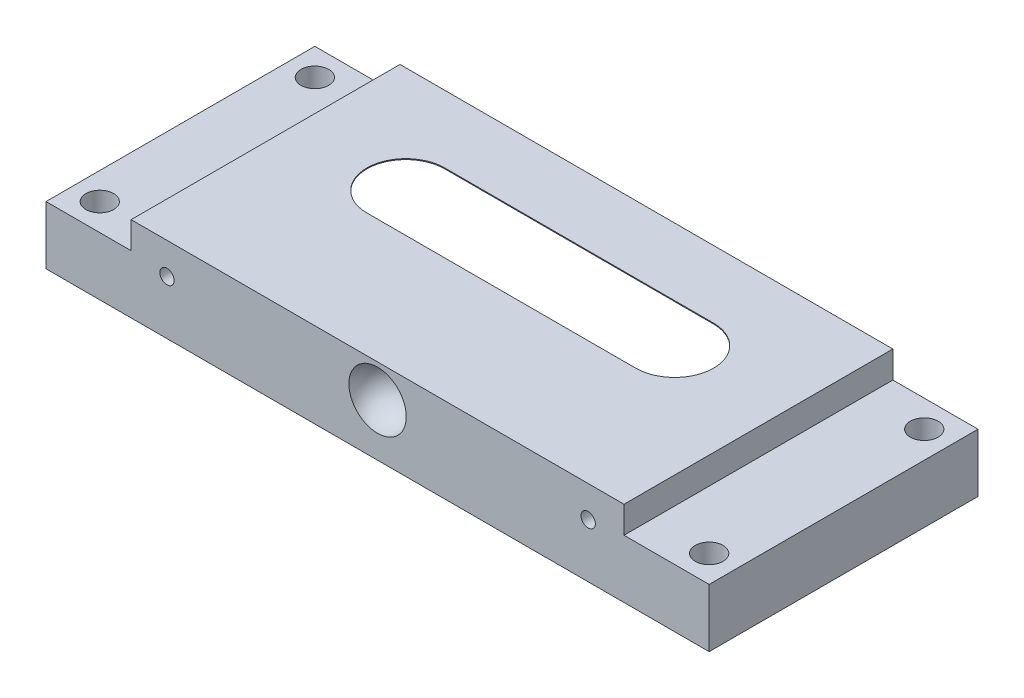
ISO-10303-21;
HEADER;
FILE_DESCRIPTION(('STEP AP214'),'2;1');
FILE_NAME('part.step','',(''),(''),'','','');
FILE_SCHEMA(('AUTOMOTIVE_DESIGN { 1 0 10303 214 1 1 1 1 }'));
ENDSEC;
DATA;
#1=APPLICATION_CONTEXT('core data for automotive mechanical design processes');
#2=APPLICATION_PROTOCOL_DEFINITION('international standard','automotive_design',2000,#1);
#3=PRODUCT_CONTEXT('',#1,'mechanical');
#4=PRODUCT('Part','Part','',(#3));
#5=PRODUCT_RELATED_PRODUCT_CATEGORY('part','',(#4));
#6=PRODUCT_DEFINITION_FORMATION('','',#4);
#7=PRODUCT_DEFINITION_CONTEXT('part definition',#1,'design');
#8=PRODUCT_DEFINITION('design','',#6,#7);
#9=PRODUCT_DEFINITION_SHAPE('','',#8);
#10=(LENGTH_UNIT() NAMED_UNIT(*) SI_UNIT(.MILLI.,.METRE.));
#11=(NAMED_UNIT(*) PLANE_ANGLE_UNIT() SI_UNIT($,.RADIAN.));
#12=(NAMED_UNIT(*) SI_UNIT($,.STERADIAN.) SOLID_ANGLE_UNIT());
#13=UNCERTAINTY_MEASURE_WITH_UNIT(LENGTH_MEASURE(1.E-05),#10,'distance_accuracy_value','');
#14=(GEOMETRIC_REPRESENTATION_CONTEXT(3) GLOBAL_UNCERTAINTY_ASSIGNED_CONTEXT((#13)) GLOBAL_UNIT_ASSIGNED_CONTEXT((#10,
#11,#12)) REPRESENTATION_CONTEXT('',''));
#15=CARTESIAN_POINT('',(0.,0.,0.));
#16=DIRECTION('',(0.,0.,1.));
#17=DIRECTION('',(1.,0.,0.));
#18=AXIS2_PLACEMENT_3D('',#15,#16,#17);
#19=CARTESIAN_POINT('',(0.,9.5,0.));
#20=DIRECTION('',(0.,0.,-1.));
#21=DIRECTION('',(-1.,0.,0.));
#22=AXIS2_PLACEMENT_3D('',#19,#20,#21);
#23=PLANE('',#22);
#24=CARTESIAN_POINT('',(60.5,6.,0.));
#25=DIRECTION('',(0.,0.,1.));
#26=DIRECTION('',(1.,0.,0.));
#27=AXIS2_PLACEMENT_3D('',#24,#25,#26);
#28=CIRCLE('',#27,0.800000000000002);
#29=CARTESIAN_POINT('',(61.3,6.,0.));
#30=VERTEX_POINT('',#29);
#31=EDGE_CURVE('E189',#30,#30,#28,.T.);
#32=ORIENTED_EDGE('',*,*,#31,.F.);
#33=EDGE_LOOP('',(#32));
#34=FACE_BOUND('',#33,.T.);
#35=CARTESIAN_POINT('',(13.5,6.,0.));
#36=DIRECTION('',(0.,0.,1.));
#37=DIRECTION('',(1.,0.,0.));
#38=AXIS2_PLACEMENT_3D('',#35,#36,#37);
#39=CIRCLE('',#38,0.800000000000001);
#40=CARTESIAN_POINT('',(14.3,6.,0.));
#41=VERTEX_POINT('',#40);
#42=EDGE_CURVE('E193',#41,#41,#39,.T.);
#43=ORIENTED_EDGE('',*,*,#42,.F.);
#44=EDGE_LOOP('',(#43));
#45=FACE_BOUND('',#44,.T.);
#46=DIRECTION('',(1.,0.,0.));
#47=VECTOR('',#46,1.);
#48=CARTESIAN_POINT('',(0.,9.5,0.));
#49=LINE('',#48,#47);
#50=CARTESIAN_POINT('',(9.5,9.5,0.));
#51=VERTEX_POINT('',#50);
#52=CARTESIAN_POINT('',(64.5,9.5,0.));
#53=VERTEX_POINT('',#52);
#54=EDGE_CURVE('E286',#51,#53,#49,.T.);
#55=ORIENTED_EDGE('',*,*,#54,.F.);
#56=DIRECTION('',(0.,1.,0.));
#57=VECTOR('',#56,1.);
#58=CARTESIAN_POINT('',(9.5,6.5,0.));
#59=LINE('',#58,#57);
#60=CARTESIAN_POINT('',(9.5,6.5,0.));
#61=VERTEX_POINT('',#60);
#62=EDGE_CURVE('E261',#61,#51,#59,.T.);
#63=ORIENTED_EDGE('',*,*,#62,.F.);
#64=DIRECTION('',(1.,0.,0.));
#65=VECTOR('',#64,1.);
#66=CARTESIAN_POINT('',(0.,6.5,0.));
#67=LINE('',#66,#65);
#68=CARTESIAN_POINT('',(0.,6.5,0.));
#69=VERTEX_POINT('',#68);
#70=EDGE_CURVE('E252',#69,#61,#67,.T.);
#71=ORIENTED_EDGE('',*,*,#70,.F.);
#72=DIRECTION('',(0.,-1.,0.));
#73=VECTOR('',#72,1.);
#74=CARTESIAN_POINT('',(0.,9.5,0.));
#75=LINE('',#74,#73);
#76=CARTESIAN_POINT('',(0.,0.,0.));
#77=VERTEX_POINT('',#76);
#78=EDGE_CURVE('E310',#69,#77,#75,.T.);
#79=ORIENTED_EDGE('',*,*,#78,.T.);
#80=DIRECTION('',(1.,0.,0.));
#81=VECTOR('',#80,1.);
#82=CARTESIAN_POINT('',(0.,0.,0.));
#83=LINE('',#82,#81);
#84=CARTESIAN_POINT('',(74.,0.,0.));
#85=VERTEX_POINT('',#84);
#86=EDGE_CURVE('E295',#77,#85,#83,.T.);
#87=ORIENTED_EDGE('',*,*,#86,.T.);
#88=DIRECTION('',(0.,-1.,0.));
#89=VECTOR('',#88,1.);
#90=CARTESIAN_POINT('',(74.,9.5,0.));
#91=LINE('',#90,#89);
#92=CARTESIAN_POINT('',(74.,6.5,0.));
#93=VERTEX_POINT('',#92);
#94=EDGE_CURVE('E308',#93,#85,#91,.T.);
#95=ORIENTED_EDGE('',*,*,#94,.F.);
#96=DIRECTION('',(1.,0.,0.));
#97=VECTOR('',#96,1.);
#98=CARTESIAN_POINT('',(74.,6.5,0.));
#99=LINE('',#98,#97);
#100=CARTESIAN_POINT('',(64.5,6.5,0.));
#101=VERTEX_POINT('',#100);
#102=EDGE_CURVE('E276',#101,#93,#99,.T.);
#103=ORIENTED_EDGE('',*,*,#102,.F.);
#104=DIRECTION('',(0.,1.,0.));
#105=VECTOR('',#104,1.);
#106=CARTESIAN_POINT('',(64.5,6.5,0.));
#107=LINE('',#106,#105);
#108=EDGE_CURVE('E281',#101,#53,#107,.T.);
#109=ORIENTED_EDGE('',*,*,#108,.T.);
#110=EDGE_LOOP('',(#55,#63,#71,#79,#87,#95,#103,#109));
#111=FACE_BOUND('',#110,.T.);
#112=CARTESIAN_POINT('',(37.,5.8,0.));
#113=DIRECTION('',(0.,0.,-1.));
#114=DIRECTION('',(-1.,0.,0.));
#115=AXIS2_PLACEMENT_3D('',#112,#113,#114);
#116=CIRCLE('',#115,3.2);
#117=CARTESIAN_POINT('',(33.8,5.8,0.));
#118=VERTEX_POINT('',#117);
#119=EDGE_CURVE('E199',#118,#118,#116,.F.);
#120=ORIENTED_EDGE('',*,*,#119,.F.);
#121=EDGE_LOOP('',(#120));
#122=FACE_BOUND('',#121,.T.);
#123=ADVANCED_FACE('F32',(#34,#45,#111,#122),#23,.F.);
#124=CARTESIAN_POINT('',(22.,-11.5,-18.15));
#125=DIRECTION('',(0.,0.,1.));
#126=DIRECTION('',(1.,0.,0.));
#127=AXIS2_PLACEMENT_3D('',#124,#125,#126);
#128=SPHERICAL_SURFACE('',#127,21.35);
#129=CARTESIAN_POINT('',(22.,-11.5,-18.15));
#130=DIRECTION('',(1.,0.,0.));
#131=DIRECTION('',(0.,0.,-1.));
#132=AXIS2_PLACEMENT_3D('',#129,#130,#131);
#133=CIRCLE('',#132,21.35);
#134=CARTESIAN_POINT('',(22.,6.25950449759227,-30.));
#135=VERTEX_POINT('',#134);
#136=CARTESIAN_POINT('',(22.,9.40215299915298,-22.5));
#137=VERTEX_POINT('',#136);
#138=EDGE_CURVE('E205',#135,#137,#133,.T.);
#139=ORIENTED_EDGE('',*,*,#138,.T.);
#140=CARTESIAN_POINT('',(22.,9.40215299915298,-18.15));
#141=DIRECTION('',(0.,-1.,0.));
#142=DIRECTION('',(0.,0.,-1.));
#143=AXIS2_PLACEMENT_3D('',#140,#141,#142);
#144=CIRCLE('',#143,4.35000000000002);
#145=CARTESIAN_POINT('',(22.,9.40215299915298,-13.8));
#146=VERTEX_POINT('',#145);
#147=EDGE_CURVE('E174',#137,#146,#144,.F.);
#148=ORIENTED_EDGE('',*,*,#147,.T.);
#149=CARTESIAN_POINT('',(22.,-11.5,-18.15));
#150=DIRECTION('',(1.,0.,0.));
#151=DIRECTION('',(0.,0.,-1.));
#152=AXIS2_PLACEMENT_3D('',#149,#150,#151);
#153=CIRCLE('',#152,21.35);
#154=CARTESIAN_POINT('',(22.,0.,-0.161878919687027));
#155=VERTEX_POINT('',#154);
#156=EDGE_CURVE('E322',#155,#146,#153,.F.);
#157=ORIENTED_EDGE('',*,*,#156,.F.);
#158=CARTESIAN_POINT('',(22.,0.,-18.15));
#159=DIRECTION('',(0.,-1.,0.));
#160=DIRECTION('',(0.,0.,-1.));
#161=AXIS2_PLACEMENT_3D('',#158,#159,#160);
#162=CIRCLE('',#161,17.988121080313);
#163=CARTESIAN_POINT('',(8.46670771763205,0.,-30.));
#164=VERTEX_POINT('',#163);
#165=EDGE_CURVE('E214',#155,#164,#162,.T.);
#166=ORIENTED_EDGE('',*,*,#165,.T.);
#167=CARTESIAN_POINT('',(22.,-11.5,-30.));
#168=DIRECTION('',(0.,0.,1.));
#169=DIRECTION('',(1.,0.,0.));
#170=AXIS2_PLACEMENT_3D('',#167,#168,#169);
#171=CIRCLE('',#170,17.7595044975923);
#172=EDGE_CURVE('E217',#135,#164,#171,.T.);
#173=ORIENTED_EDGE('',*,*,#172,.F.);
#174=EDGE_LOOP('',(#139,#148,#157,#166,#173));
#175=FACE_BOUND('',#174,.T.);
#176=ADVANCED_FACE('F344',(#175),#128,.F.);
#177=CARTESIAN_POINT('',(0.,9.5,-30.));
#178=DIRECTION('',(0.,0.,1.));
#179=DIRECTION('',(1.,0.,0.));
#180=AXIS2_PLACEMENT_3D('',#177,#178,#179);
#181=PLANE('',#180);
#182=CARTESIAN_POINT('',(6.5,4.5,-30.));
#183=DIRECTION('',(0.,0.,-1.));
#184=DIRECTION('',(-1.,0.,0.));
#185=AXIS2_PLACEMENT_3D('',#182,#183,#184);
#186=CIRCLE('',#185,1.24999999999999);
#187=CARTESIAN_POINT('',(5.25000000000001,4.5,-30.));
#188=VERTEX_POINT('',#187);
#189=EDGE_CURVE('E177',#188,#188,#186,.T.);
#190=ORIENTED_EDGE('',*,*,#189,.F.);
#191=EDGE_LOOP('',(#190));
#192=FACE_BOUND('',#191,.T.);
#193=CARTESIAN_POINT('',(67.5,4.5,-30.));
#194=DIRECTION('',(0.,0.,-1.));
#195=DIRECTION('',(-1.,0.,0.));
#196=AXIS2_PLACEMENT_3D('',#193,#194,#195);
#197=CIRCLE('',#196,1.24999999999999);
#198=CARTESIAN_POINT('',(66.25,4.5,-30.));
#199=VERTEX_POINT('',#198);
#200=EDGE_CURVE('E183',#199,#199,#197,.T.);
#201=ORIENTED_EDGE('',*,*,#200,.F.);
#202=EDGE_LOOP('',(#201));
#203=FACE_BOUND('',#202,.T.);
#204=CARTESIAN_POINT('',(52.,-11.5,-30.));
#205=DIRECTION('',(0.,0.,1.));
#206=DIRECTION('',(1.,0.,0.));
#207=AXIS2_PLACEMENT_3D('',#204,#205,#206);
#208=CIRCLE('',#207,17.7595044975923);
#209=CARTESIAN_POINT('',(52.,6.25950449759227,-30.));
#210=VERTEX_POINT('',#209);
#211=CARTESIAN_POINT('',(65.533292282368,0.,-30.));
#212=VERTEX_POINT('',#211);
#213=EDGE_CURVE('E219',#210,#212,#208,.F.);
#214=ORIENTED_EDGE('',*,*,#213,.F.);
#215=DIRECTION('',(1.,0.,0.));
#216=VECTOR('',#215,1.);
#217=CARTESIAN_POINT('',(52.,6.25950449759227,-30.));
#218=LINE('',#217,#216);
#219=EDGE_CURVE('E211',#210,#135,#218,.F.);
#220=ORIENTED_EDGE('',*,*,#219,.T.);
#221=ORIENTED_EDGE('',*,*,#172,.T.);
#222=DIRECTION('',(-1.,0.,0.));
#223=VECTOR('',#222,1.);
#224=CARTESIAN_POINT('',(0.,0.,-30.));
#225=LINE('',#224,#223);
#226=CARTESIAN_POINT('',(0.,0.,-30.));
#227=VERTEX_POINT('',#226);
#228=EDGE_CURVE('E301',#164,#227,#225,.T.);
#229=ORIENTED_EDGE('',*,*,#228,.T.);
#230=DIRECTION('',(0.,-1.,0.));
#231=VECTOR('',#230,1.);
#232=CARTESIAN_POINT('',(0.,9.5,-30.));
#233=LINE('',#232,#231);
#234=CARTESIAN_POINT('',(0.,6.5,-30.));
#235=VERTEX_POINT('',#234);
#236=EDGE_CURVE('E292',#235,#227,#233,.T.);
#237=ORIENTED_EDGE('',*,*,#236,.F.);
#238=DIRECTION('',(-1.,0.,0.));
#239=VECTOR('',#238,1.);
#240=CARTESIAN_POINT('',(0.,6.5,-30.));
#241=LINE('',#240,#239);
#242=CARTESIAN_POINT('',(9.5,6.5,-30.));
#243=VERTEX_POINT('',#242);
#244=EDGE_CURVE('E259',#243,#235,#241,.T.);
#245=ORIENTED_EDGE('',*,*,#244,.F.);
#246=DIRECTION('',(0.,1.,0.));
#247=VECTOR('',#246,1.);
#248=CARTESIAN_POINT('',(9.5,6.5,-30.));
#249=LINE('',#248,#247);
#250=CARTESIAN_POINT('',(9.5,9.5,-30.));
#251=VERTEX_POINT('',#250);
#252=EDGE_CURVE('E263',#243,#251,#249,.T.);
#253=ORIENTED_EDGE('',*,*,#252,.T.);
#254=DIRECTION('',(-1.,0.,0.));
#255=VECTOR('',#254,1.);
#256=CARTESIAN_POINT('',(0.,9.5,-30.));
#257=LINE('',#256,#255);
#258=CARTESIAN_POINT('',(64.5,9.5,-30.));
#259=VERTEX_POINT('',#258);
#260=EDGE_CURVE('E288',#259,#251,#257,.T.);
#261=ORIENTED_EDGE('',*,*,#260,.F.);
#262=DIRECTION('',(0.,1.,0.));
#263=VECTOR('',#262,1.);
#264=CARTESIAN_POINT('',(64.5,6.5,-30.));
#265=LINE('',#264,#263);
#266=CARTESIAN_POINT('',(64.5,6.5,-30.));
#267=VERTEX_POINT('',#266);
#268=EDGE_CURVE('E278',#267,#259,#265,.T.);
#269=ORIENTED_EDGE('',*,*,#268,.F.);
#270=DIRECTION('',(-1.,0.,0.));
#271=VECTOR('',#270,1.);
#272=CARTESIAN_POINT('',(74.,6.5,-30.));
#273=LINE('',#272,#271);
#274=CARTESIAN_POINT('',(74.,6.5,-30.));
#275=VERTEX_POINT('',#274);
#276=EDGE_CURVE('E270',#275,#267,#273,.T.);
#277=ORIENTED_EDGE('',*,*,#276,.F.);
#278=DIRECTION('',(0.,-1.,0.));
#279=VECTOR('',#278,1.);
#280=CARTESIAN_POINT('',(74.,9.5,-30.));
#281=LINE('',#280,#279);
#282=CARTESIAN_POINT('',(74.,0.,-30.));
#283=VERTEX_POINT('',#282);
#284=EDGE_CURVE('E306',#275,#283,#281,.T.);
#285=ORIENTED_EDGE('',*,*,#284,.T.);
#286=EDGE_CURVE('E289',#283,#212,#225,.T.);
#287=ORIENTED_EDGE('',*,*,#286,.T.);
#288=EDGE_LOOP('',(#214,#220,#221,#229,#237,#245,#253,#261,#269,#277,#285,#287));
#289=FACE_BOUND('',#288,.T.);
#290=ADVANCED_FACE('F353',(#192,#203,#289),#181,.F.);
#291=CARTESIAN_POINT('',(0.,9.5,0.));
#292=DIRECTION('',(0.,-1.,0.));
#293=DIRECTION('',(0.,0.,-1.));
#294=AXIS2_PLACEMENT_3D('',#291,#292,#293);
#295=PLANE('',#294);
#296=DIRECTION('',(1.,0.,0.));
#297=VECTOR('',#296,1.);
#298=CARTESIAN_POINT('',(52.,9.5,-13.8));
#299=LINE('',#298,#297);
#300=CARTESIAN_POINT('',(22.,9.5,-13.8));
#301=VERTEX_POINT('',#300);
#302=CARTESIAN_POINT('',(52.,9.5,-13.8));
#303=VERTEX_POINT('',#302);
#304=EDGE_CURVE('E157',#301,#303,#299,.T.);
#305=ORIENTED_EDGE('',*,*,#304,.F.);
#306=CARTESIAN_POINT('',(22.,9.5,-18.15));
#307=DIRECTION('',(0.,1.,0.));
#308=DIRECTION('',(0.,0.,1.));
#309=AXIS2_PLACEMENT_3D('',#306,#307,#308);
#310=CIRCLE('',#309,4.35000000000002);
#311=CARTESIAN_POINT('',(22.,9.5,-22.5));
#312=VERTEX_POINT('',#311);
#313=EDGE_CURVE('E47',#312,#301,#310,.T.);
#314=ORIENTED_EDGE('',*,*,#313,.F.);
#315=DIRECTION('',(-1.,0.,0.));
#316=VECTOR('',#315,1.);
#317=CARTESIAN_POINT('',(22.,9.5,-22.5));
#318=LINE('',#317,#316);
#319=CARTESIAN_POINT('',(52.,9.5,-22.5));
#320=VERTEX_POINT('',#319);
#321=EDGE_CURVE('E164',#320,#312,#318,.T.);
#322=ORIENTED_EDGE('',*,*,#321,.F.);
#323=CARTESIAN_POINT('',(52.,9.5,-18.15));
#324=DIRECTION('',(0.,1.,0.));
#325=DIRECTION('',(0.,0.,1.));
#326=AXIS2_PLACEMENT_3D('',#323,#324,#325);
#327=CIRCLE('',#326,4.35000000000001);
#328=EDGE_CURVE('E148',#303,#320,#327,.T.);
#329=ORIENTED_EDGE('',*,*,#328,.F.);
#330=EDGE_LOOP('',(#305,#314,#322,#329));
#331=FACE_BOUND('',#330,.T.);
#332=ORIENTED_EDGE('',*,*,#260,.T.);
#333=DIRECTION('',(0.,0.,-1.));
#334=VECTOR('',#333,1.);
#335=CARTESIAN_POINT('',(9.5,9.5,-30.));
#336=LINE('',#335,#334);
#337=EDGE_CURVE('E253',#51,#251,#336,.T.);
#338=ORIENTED_EDGE('',*,*,#337,.F.);
#339=ORIENTED_EDGE('',*,*,#54,.T.);
#340=DIRECTION('',(0.,0.,1.));
#341=VECTOR('',#340,1.);
#342=CARTESIAN_POINT('',(64.5,9.5,-30.));
#343=LINE('',#342,#341);
#344=EDGE_CURVE('E266',#259,#53,#343,.T.);
#345=ORIENTED_EDGE('',*,*,#344,.F.);
#346=EDGE_LOOP('',(#332,#338,#339,#345));
#347=FACE_BOUND('',#346,.T.);
#348=ADVANCED_FACE('F161',(#331,#347),#295,.F.);
#349=CARTESIAN_POINT('',(0.,0.,0.));
#350=DIRECTION('',(0.,-1.,0.));
#351=DIRECTION('',(0.,0.,-1.));
#352=AXIS2_PLACEMENT_3D('',#349,#350,#351);
#353=PLANE('',#352);
#354=DIRECTION('',(1.,0.,0.));
#355=VECTOR('',#354,1.);
#356=CARTESIAN_POINT('',(52.,0.,-0.161878919687025));
#357=LINE('',#356,#355);
#358=CARTESIAN_POINT('',(52.,0.,-0.161878919687025));
#359=VERTEX_POINT('',#358);
#360=EDGE_CURVE('E209',#359,#155,#357,.F.);
#361=ORIENTED_EDGE('',*,*,#360,.F.);
#362=CARTESIAN_POINT('',(52.,0.,-18.15));
#363=DIRECTION('',(0.,-1.,0.));
#364=DIRECTION('',(0.,0.,-1.));
#365=AXIS2_PLACEMENT_3D('',#362,#363,#364);
#366=CIRCLE('',#365,17.988121080313);
#367=EDGE_CURVE('E312',#359,#212,#366,.F.);
#368=ORIENTED_EDGE('',*,*,#367,.T.);
#369=ORIENTED_EDGE('',*,*,#286,.F.);
#370=DIRECTION('',(0.,0.,-1.));
#371=VECTOR('',#370,1.);
#372=CARTESIAN_POINT('',(74.,0.,0.));
#373=LINE('',#372,#371);
#374=EDGE_CURVE('E298',#85,#283,#373,.T.);
#375=ORIENTED_EDGE('',*,*,#374,.F.);
#376=ORIENTED_EDGE('',*,*,#86,.F.);
#377=DIRECTION('',(0.,0.,1.));
#378=VECTOR('',#377,1.);
#379=CARTESIAN_POINT('',(0.,0.,0.));
#380=LINE('',#379,#378);
#381=EDGE_CURVE('E284',#227,#77,#380,.T.);
#382=ORIENTED_EDGE('',*,*,#381,.F.);
#383=ORIENTED_EDGE('',*,*,#228,.F.);
#384=ORIENTED_EDGE('',*,*,#165,.F.);
#385=EDGE_LOOP('',(#361,#368,#369,#375,#376,#382,#383,#384));
#386=FACE_BOUND('',#385,.T.);
#387=CARTESIAN_POINT('',(71.,0.,-3.));
#388=DIRECTION('',(0.,-1.,0.));
#389=DIRECTION('',(0.,0.,-1.));
#390=AXIS2_PLACEMENT_3D('',#387,#388,#389);
#391=CIRCLE('',#390,2.69999999999999);
#392=CARTESIAN_POINT('',(71.,0.,-5.69999999999999));
#393=VERTEX_POINT('',#392);
#394=EDGE_CURVE('E243',#393,#393,#391,.T.);
#395=ORIENTED_EDGE('',*,*,#394,.F.);
#396=EDGE_LOOP('',(#395));
#397=FACE_BOUND('',#396,.T.);
#398=CARTESIAN_POINT('',(71.,0.,-27.));
#399=DIRECTION('',(0.,-1.,0.));
#400=DIRECTION('',(0.,0.,-1.));
#401=AXIS2_PLACEMENT_3D('',#398,#399,#400);
#402=CIRCLE('',#401,2.69999999999999);
#403=CARTESIAN_POINT('',(71.,0.,-29.7));
#404=VERTEX_POINT('',#403);
#405=EDGE_CURVE('E236',#404,#404,#402,.T.);
#406=ORIENTED_EDGE('',*,*,#405,.F.);
#407=EDGE_LOOP('',(#406));
#408=FACE_BOUND('',#407,.T.);
#409=CARTESIAN_POINT('',(3.,0.,-27.));
#410=DIRECTION('',(0.,-1.,0.));
#411=DIRECTION('',(0.,0.,-1.));
#412=AXIS2_PLACEMENT_3D('',#409,#410,#411);
#413=CIRCLE('',#412,2.7);
#414=CARTESIAN_POINT('',(3.,0.,-29.7));
#415=VERTEX_POINT('',#414);
#416=EDGE_CURVE('E229',#415,#415,#413,.T.);
#417=ORIENTED_EDGE('',*,*,#416,.F.);
#418=EDGE_LOOP('',(#417));
#419=FACE_BOUND('',#418,.T.);
#420=CARTESIAN_POINT('',(3.,0.,-3.));
#421=DIRECTION('',(0.,-1.,0.));
#422=DIRECTION('',(0.,0.,-1.));
#423=AXIS2_PLACEMENT_3D('',#420,#421,#422);
#424=CIRCLE('',#423,2.7);
#425=CARTESIAN_POINT('',(3.,0.,-5.7));
#426=VERTEX_POINT('',#425);
#427=EDGE_CURVE('E222',#426,#426,#424,.T.);
#428=ORIENTED_EDGE('',*,*,#427,.F.);
#429=EDGE_LOOP('',(#428));
#430=FACE_BOUND('',#429,.T.);
#431=ADVANCED_FACE('F338',(#386,#397,#408,#419,#430),#353,.T.);
#432=CARTESIAN_POINT('',(0.,9.5,0.));
#433=DIRECTION('',(1.,0.,0.));
#434=DIRECTION('',(0.,0.,-1.));
#435=AXIS2_PLACEMENT_3D('',#432,#433,#434);
#436=PLANE('',#435);
#437=DIRECTION('',(0.,0.,1.));
#438=VECTOR('',#437,1.);
#439=CARTESIAN_POINT('',(0.,6.5,-30.));
#440=LINE('',#439,#438);
#441=EDGE_CURVE('E250',#235,#69,#440,.T.);
#442=ORIENTED_EDGE('',*,*,#441,.F.);
#443=ORIENTED_EDGE('',*,*,#236,.T.);
#444=ORIENTED_EDGE('',*,*,#381,.T.);
#445=ORIENTED_EDGE('',*,*,#78,.F.);
#446=EDGE_LOOP('',(#442,#443,#444,#445));
#447=FACE_BOUND('',#446,.T.);
#448=ADVANCED_FACE('F34',(#447),#436,.F.);
#449=CARTESIAN_POINT('',(74.,9.5,0.));
#450=DIRECTION('',(-1.,0.,0.));
#451=DIRECTION('',(0.,0.,1.));
#452=AXIS2_PLACEMENT_3D('',#449,#450,#451);
#453=PLANE('',#452);
#454=ORIENTED_EDGE('',*,*,#284,.F.);
#455=DIRECTION('',(0.,0.,-1.));
#456=VECTOR('',#455,1.);
#457=CARTESIAN_POINT('',(74.,6.5,-30.));
#458=LINE('',#457,#456);
#459=EDGE_CURVE('E268',#93,#275,#458,.T.);
#460=ORIENTED_EDGE('',*,*,#459,.F.);
#461=ORIENTED_EDGE('',*,*,#94,.T.);
#462=ORIENTED_EDGE('',*,*,#374,.T.);
#463=EDGE_LOOP('',(#454,#460,#461,#462));
#464=FACE_BOUND('',#463,.T.);
#465=ADVANCED_FACE('F359',(#464),#453,.F.);
#466=CARTESIAN_POINT('',(64.5,6.5,-30.));
#467=DIRECTION('',(-1.,0.,0.));
#468=DIRECTION('',(0.,0.,1.));
#469=AXIS2_PLACEMENT_3D('',#466,#467,#468);
#470=PLANE('',#469);
#471=ORIENTED_EDGE('',*,*,#344,.T.);
#472=ORIENTED_EDGE('',*,*,#108,.F.);
#473=DIRECTION('',(0.,0.,1.));
#474=VECTOR('',#473,1.);
#475=CARTESIAN_POINT('',(64.5,6.5,-30.));
#476=LINE('',#475,#474);
#477=EDGE_CURVE('E273',#267,#101,#476,.T.);
#478=ORIENTED_EDGE('',*,*,#477,.F.);
#479=ORIENTED_EDGE('',*,*,#268,.T.);
#480=EDGE_LOOP('',(#471,#472,#478,#479));
#481=FACE_BOUND('',#480,.T.);
#482=ADVANCED_FACE('F382',(#481),#470,.F.);
#483=CARTESIAN_POINT('',(0.,6.5,0.));
#484=DIRECTION('',(0.,-1.,0.));
#485=DIRECTION('',(0.,0.,-1.));
#486=AXIS2_PLACEMENT_3D('',#483,#484,#485);
#487=PLANE('',#486);
#488=CARTESIAN_POINT('',(71.,6.5,-27.));
#489=DIRECTION('',(0.,-1.,0.));
#490=DIRECTION('',(0.,0.,-1.));
#491=AXIS2_PLACEMENT_3D('',#488,#489,#490);
#492=CIRCLE('',#491,1.55);
#493=CARTESIAN_POINT('',(71.,6.5,-28.55));
#494=VERTEX_POINT('',#493);
#495=EDGE_CURVE('E242',#494,#494,#492,.T.);
#496=ORIENTED_EDGE('',*,*,#495,.T.);
#497=EDGE_LOOP('',(#496));
#498=FACE_BOUND('',#497,.T.);
#499=CARTESIAN_POINT('',(71.,6.5,-3.));
#500=DIRECTION('',(0.,-1.,0.));
#501=DIRECTION('',(0.,0.,-1.));
#502=AXIS2_PLACEMENT_3D('',#499,#500,#501);
#503=CIRCLE('',#502,1.55);
#504=CARTESIAN_POINT('',(71.,6.5,-4.55));
#505=VERTEX_POINT('',#504);
#506=EDGE_CURVE('E249',#505,#505,#503,.T.);
#507=ORIENTED_EDGE('',*,*,#506,.T.);
#508=EDGE_LOOP('',(#507));
#509=FACE_BOUND('',#508,.T.);
#510=ORIENTED_EDGE('',*,*,#459,.T.);
#511=ORIENTED_EDGE('',*,*,#276,.T.);
#512=ORIENTED_EDGE('',*,*,#477,.T.);
#513=ORIENTED_EDGE('',*,*,#102,.T.);
#514=EDGE_LOOP('',(#510,#511,#512,#513));
#515=FACE_BOUND('',#514,.T.);
#516=ADVANCED_FACE('F384',(#498,#509,#515),#487,.F.);
#517=CARTESIAN_POINT('',(9.5,6.5,-30.));
#518=DIRECTION('',(1.,0.,0.));
#519=DIRECTION('',(0.,0.,-1.));
#520=AXIS2_PLACEMENT_3D('',#517,#518,#519);
#521=PLANE('',#520);
#522=ORIENTED_EDGE('',*,*,#337,.T.);
#523=ORIENTED_EDGE('',*,*,#252,.F.);
#524=DIRECTION('',(0.,0.,-1.));
#525=VECTOR('',#524,1.);
#526=CARTESIAN_POINT('',(9.5,6.5,-30.));
#527=LINE('',#526,#525);
#528=EDGE_CURVE('E256',#61,#243,#527,.T.);
#529=ORIENTED_EDGE('',*,*,#528,.F.);
#530=ORIENTED_EDGE('',*,*,#62,.T.);
#531=EDGE_LOOP('',(#522,#523,#529,#530));
#532=FACE_BOUND('',#531,.T.);
#533=ADVANCED_FACE('F375',(#532),#521,.F.);
#534=CARTESIAN_POINT('',(0.,6.5,0.));
#535=DIRECTION('',(0.,1.,0.));
#536=DIRECTION('',(0.,0.,1.));
#537=AXIS2_PLACEMENT_3D('',#534,#535,#536);
#538=PLANE('',#537);
#539=CARTESIAN_POINT('',(3.,6.5,-3.));
#540=DIRECTION('',(0.,1.,0.));
#541=DIRECTION('',(0.,0.,1.));
#542=AXIS2_PLACEMENT_3D('',#539,#540,#541);
#543=CIRCLE('',#542,1.55);
#544=CARTESIAN_POINT('',(3.,6.5,-1.45));
#545=VERTEX_POINT('',#544);
#546=EDGE_CURVE('E228',#545,#545,#543,.T.);
#547=ORIENTED_EDGE('',*,*,#546,.F.);
#548=EDGE_LOOP('',(#547));
#549=FACE_BOUND('',#548,.T.);
#550=CARTESIAN_POINT('',(3.,6.5,-27.));
#551=DIRECTION('',(0.,1.,0.));
#552=DIRECTION('',(0.,0.,1.));
#553=AXIS2_PLACEMENT_3D('',#550,#551,#552);
#554=CIRCLE('',#553,1.55);
#555=CARTESIAN_POINT('',(3.,6.5,-25.45));
#556=VERTEX_POINT('',#555);
#557=EDGE_CURVE('E235',#556,#556,#554,.T.);
#558=ORIENTED_EDGE('',*,*,#557,.F.);
#559=EDGE_LOOP('',(#558));
#560=FACE_BOUND('',#559,.T.);
#561=ORIENTED_EDGE('',*,*,#441,.T.);
#562=ORIENTED_EDGE('',*,*,#70,.T.);
#563=ORIENTED_EDGE('',*,*,#528,.T.);
#564=ORIENTED_EDGE('',*,*,#244,.T.);
#565=EDGE_LOOP('',(#561,#562,#563,#564));
#566=FACE_BOUND('',#565,.T.);
#567=ADVANCED_FACE('F371',(#549,#560,#566),#538,.T.);
#568=CARTESIAN_POINT('',(71.,0.,-3.));
#569=DIRECTION('',(0.,-1.,0.));
#570=DIRECTION('',(0.,0.,-1.));
#571=AXIS2_PLACEMENT_3D('',#568,#569,#570);
#572=CYLINDRICAL_SURFACE('',#571,1.55);
#573=CARTESIAN_POINT('',(71.,1.15,-3.));
#574=DIRECTION('',(0.,-1.,0.));
#575=DIRECTION('',(0.,0.,-1.));
#576=AXIS2_PLACEMENT_3D('',#573,#574,#575);
#577=CIRCLE('',#576,1.55);
#578=CARTESIAN_POINT('',(71.,1.15,-4.55));
#579=VERTEX_POINT('',#578);
#580=EDGE_CURVE('E246',#579,#579,#577,.T.);
#581=ORIENTED_EDGE('',*,*,#580,.T.);
#582=EDGE_LOOP('',(#581));
#583=FACE_BOUND('',#582,.T.);
#584=ORIENTED_EDGE('',*,*,#506,.F.);
#585=EDGE_LOOP('',(#584));
#586=FACE_BOUND('',#585,.T.);
#587=ADVANCED_FACE('F456',(#583,#586),#572,.F.);
#588=CARTESIAN_POINT('',(71.,0.,-3.));
#589=DIRECTION('',(0.,-1.,0.));
#590=DIRECTION('',(0.,0.,-1.));
#591=AXIS2_PLACEMENT_3D('',#588,#589,#590);
#592=CONICAL_SURFACE('',#591,2.69999999999999,0.785398163397447);
#593=ORIENTED_EDGE('',*,*,#580,.F.);
#594=EDGE_LOOP('',(#593));
#595=FACE_BOUND('',#594,.T.);
#596=ORIENTED_EDGE('',*,*,#394,.T.);
#597=EDGE_LOOP('',(#596));
#598=FACE_BOUND('',#597,.T.);
#599=ADVANCED_FACE('F466',(#595,#598),#592,.F.);
#600=CARTESIAN_POINT('',(71.,0.,-27.));
#601=DIRECTION('',(0.,-1.,0.));
#602=DIRECTION('',(0.,0.,-1.));
#603=AXIS2_PLACEMENT_3D('',#600,#601,#602);
#604=CYLINDRICAL_SURFACE('',#603,1.55);
#605=CARTESIAN_POINT('',(71.,1.15,-27.));
#606=DIRECTION('',(0.,-1.,0.));
#607=DIRECTION('',(0.,0.,-1.));
#608=AXIS2_PLACEMENT_3D('',#605,#606,#607);
#609=CIRCLE('',#608,1.55);
#610=CARTESIAN_POINT('',(71.,1.15,-28.55));
#611=VERTEX_POINT('',#610);
#612=EDGE_CURVE('E239',#611,#611,#609,.T.);
#613=ORIENTED_EDGE('',*,*,#612,.T.);
#614=EDGE_LOOP('',(#613));
#615=FACE_BOUND('',#614,.T.);
#616=ORIENTED_EDGE('',*,*,#495,.F.);
#617=EDGE_LOOP('',(#616));
#618=FACE_BOUND('',#617,.T.);
#619=ADVANCED_FACE('F476',(#615,#618),#604,.F.);
#620=CARTESIAN_POINT('',(71.,0.,-27.));
#621=DIRECTION('',(0.,-1.,0.));
#622=DIRECTION('',(0.,0.,-1.));
#623=AXIS2_PLACEMENT_3D('',#620,#621,#622);
#624=CONICAL_SURFACE('',#623,2.69999999999999,0.785398163397447);
#625=ORIENTED_EDGE('',*,*,#612,.F.);
#626=EDGE_LOOP('',(#625));
#627=FACE_BOUND('',#626,.T.);
#628=ORIENTED_EDGE('',*,*,#405,.T.);
#629=EDGE_LOOP('',(#628));
#630=FACE_BOUND('',#629,.T.);
#631=ADVANCED_FACE('F486',(#627,#630),#624,.F.);
#632=CARTESIAN_POINT('',(3.,0.,-27.));
#633=DIRECTION('',(0.,-1.,0.));
#634=DIRECTION('',(0.,0.,-1.));
#635=AXIS2_PLACEMENT_3D('',#632,#633,#634);
#636=CYLINDRICAL_SURFACE('',#635,1.55);
#637=ORIENTED_EDGE('',*,*,#557,.T.);
#638=EDGE_LOOP('',(#637));
#639=FACE_BOUND('',#638,.T.);
#640=CARTESIAN_POINT('',(3.,1.15,-27.));
#641=DIRECTION('',(0.,-1.,0.));
#642=DIRECTION('',(0.,0.,-1.));
#643=AXIS2_PLACEMENT_3D('',#640,#641,#642);
#644=CIRCLE('',#643,1.55);
#645=CARTESIAN_POINT('',(3.,1.15,-28.55));
#646=VERTEX_POINT('',#645);
#647=EDGE_CURVE('E232',#646,#646,#644,.T.);
#648=ORIENTED_EDGE('',*,*,#647,.T.);
#649=EDGE_LOOP('',(#648));
#650=FACE_BOUND('',#649,.T.);
#651=ADVANCED_FACE('F496',(#639,#650),#636,.F.);
#652=CARTESIAN_POINT('',(3.,0.,-27.));
#653=DIRECTION('',(0.,-1.,0.));
#654=DIRECTION('',(0.,0.,-1.));
#655=AXIS2_PLACEMENT_3D('',#652,#653,#654);
#656=CONICAL_SURFACE('',#655,2.7,0.785398163397448);
#657=ORIENTED_EDGE('',*,*,#647,.F.);
#658=EDGE_LOOP('',(#657));
#659=FACE_BOUND('',#658,.T.);
#660=ORIENTED_EDGE('',*,*,#416,.T.);
#661=EDGE_LOOP('',(#660));
#662=FACE_BOUND('',#661,.T.);
#663=ADVANCED_FACE('F506',(#659,#662),#656,.F.);
#664=CARTESIAN_POINT('',(3.,0.,-3.));
#665=DIRECTION('',(0.,-1.,0.));
#666=DIRECTION('',(0.,0.,-1.));
#667=AXIS2_PLACEMENT_3D('',#664,#665,#666);
#668=CYLINDRICAL_SURFACE('',#667,1.55);
#669=ORIENTED_EDGE('',*,*,#546,.T.);
#670=EDGE_LOOP('',(#669));
#671=FACE_BOUND('',#670,.T.);
#672=CARTESIAN_POINT('',(3.,1.15,-3.));
#673=DIRECTION('',(0.,-1.,0.));
#674=DIRECTION('',(0.,0.,-1.));
#675=AXIS2_PLACEMENT_3D('',#672,#673,#674);
#676=CIRCLE('',#675,1.55);
#677=CARTESIAN_POINT('',(3.,1.15,-4.55));
#678=VERTEX_POINT('',#677);
#679=EDGE_CURVE('E225',#678,#678,#676,.T.);
#680=ORIENTED_EDGE('',*,*,#679,.T.);
#681=EDGE_LOOP('',(#680));
#682=FACE_BOUND('',#681,.T.);
#683=ADVANCED_FACE('F516',(#671,#682),#668,.F.);
#684=CARTESIAN_POINT('',(3.,0.,-3.));
#685=DIRECTION('',(0.,-1.,0.));
#686=DIRECTION('',(0.,0.,-1.));
#687=AXIS2_PLACEMENT_3D('',#684,#685,#686);
#688=CONICAL_SURFACE('',#687,2.7,0.785398163397448);
#689=ORIENTED_EDGE('',*,*,#679,.F.);
#690=EDGE_LOOP('',(#689));
#691=FACE_BOUND('',#690,.T.);
#692=ORIENTED_EDGE('',*,*,#427,.T.);
#693=EDGE_LOOP('',(#692));
#694=FACE_BOUND('',#693,.T.);
#695=ADVANCED_FACE('F525',(#691,#694),#688,.F.);
#696=CARTESIAN_POINT('',(52.,-11.5,-18.15));
#697=DIRECTION('',(0.,0.,1.));
#698=DIRECTION('',(1.,0.,0.));
#699=AXIS2_PLACEMENT_3D('',#696,#697,#698);
#700=SPHERICAL_SURFACE('',#699,21.35);
#701=CARTESIAN_POINT('',(52.,9.40215299915298,-18.15));
#702=DIRECTION('',(0.,-1.,0.));
#703=DIRECTION('',(0.,0.,-1.));
#704=AXIS2_PLACEMENT_3D('',#701,#702,#703);
#705=CIRCLE('',#704,4.35000000000001);
#706=CARTESIAN_POINT('',(52.,9.40215299915298,-22.5));
#707=VERTEX_POINT('',#706);
#708=CARTESIAN_POINT('',(52.,9.40215299915298,-13.8));
#709=VERTEX_POINT('',#708);
#710=EDGE_CURVE('E151',#707,#709,#705,.T.);
#711=ORIENTED_EDGE('',*,*,#710,.F.);
#712=CARTESIAN_POINT('',(52.,-11.5,-18.15));
#713=DIRECTION('',(1.,0.,0.));
#714=DIRECTION('',(0.,0.,-1.));
#715=AXIS2_PLACEMENT_3D('',#712,#713,#714);
#716=CIRCLE('',#715,21.35);
#717=EDGE_CURVE('E202',#210,#707,#716,.T.);
#718=ORIENTED_EDGE('',*,*,#717,.F.);
#719=ORIENTED_EDGE('',*,*,#213,.T.);
#720=ORIENTED_EDGE('',*,*,#367,.F.);
#721=EDGE_CURVE('E206',#709,#359,#716,.T.);
#722=ORIENTED_EDGE('',*,*,#721,.F.);
#723=EDGE_LOOP('',(#711,#718,#719,#720,#722));
#724=FACE_BOUND('',#723,.T.);
#725=ADVANCED_FACE('F333',(#724),#700,.F.);
#726=CARTESIAN_POINT('',(52.,-11.5,-18.15));
#727=DIRECTION('',(1.,0.,0.));
#728=DIRECTION('',(0.,0.,-1.));
#729=AXIS2_PLACEMENT_3D('',#726,#727,#728);
#730=CYLINDRICAL_SURFACE('',#729,21.35);
#731=ORIENTED_EDGE('',*,*,#717,.T.);
#732=DIRECTION('',(1.,0.,0.));
#733=VECTOR('',#732,1.);
#734=CARTESIAN_POINT('',(52.,9.40215299915298,-22.5));
#735=LINE('',#734,#733);
#736=EDGE_CURVE('E11',#707,#137,#735,.F.);
#737=ORIENTED_EDGE('',*,*,#736,.T.);
#738=ORIENTED_EDGE('',*,*,#138,.F.);
#739=ORIENTED_EDGE('',*,*,#219,.F.);
#740=EDGE_LOOP('',(#731,#737,#738,#739));
#741=FACE_BOUND('',#740,.T.);
#742=ADVANCED_FACE('F351',(#741),#730,.F.);
#743=ORIENTED_EDGE('',*,*,#156,.T.);
#744=DIRECTION('',(1.,0.,0.));
#745=VECTOR('',#744,1.);
#746=CARTESIAN_POINT('',(52.,9.40215299915298,-13.8));
#747=LINE('',#746,#745);
#748=EDGE_CURVE('E40',#146,#709,#747,.T.);
#749=ORIENTED_EDGE('',*,*,#748,.T.);
#750=ORIENTED_EDGE('',*,*,#721,.T.);
#751=ORIENTED_EDGE('',*,*,#360,.T.);
#752=EDGE_LOOP('',(#743,#749,#750,#751));
#753=FACE_BOUND('',#752,.T.);
#754=ADVANCED_FACE('F328',(#753),#730,.F.);
#755=CARTESIAN_POINT('',(37.,5.8,0.));
#756=DIRECTION('',(0.,1.,0.));
#757=DIRECTION('',(1.,0.,0.));
#758=AXIS2_PLACEMENT_3D('',#755,#756,#757);
#759=SPHERICAL_SURFACE('',#758,3.2);
#760=CARTESIAN_POINT('',(37.,5.8,0.));
#761=DIRECTION('',(0.,0.,-1.));
#762=DIRECTION('',(-1.,0.,0.));
#763=AXIS2_PLACEMENT_3D('',#760,#761,#762);
#764=SPHERICAL_SURFACE('',#763,3.2);
#765=ORIENTED_EDGE('',*,*,#119,.T.);
#766=EDGE_LOOP('',(#765));
#767=FACE_BOUND('',#766,.T.);
#768=ADVANCED_FACE('F554',(#767),#764,.F.);
#769=CARTESIAN_POINT('',(13.5,6.,-6.));
#770=DIRECTION('',(0.,0.,1.));
#771=DIRECTION('',(1.,0.,0.));
#772=AXIS2_PLACEMENT_3D('',#769,#770,#771);
#773=CYLINDRICAL_SURFACE('',#772,0.800000000000001);
#774=CARTESIAN_POINT('',(13.5,6.,-6.));
#775=DIRECTION('',(0.,0.,1.));
#776=DIRECTION('',(1.,0.,0.));
#777=AXIS2_PLACEMENT_3D('',#774,#775,#776);
#778=CIRCLE('',#777,0.800000000000001);
#779=CARTESIAN_POINT('',(14.3,6.,-6.));
#780=VERTEX_POINT('',#779);
#781=EDGE_CURVE('E196',#780,#780,#778,.T.);
#782=ORIENTED_EDGE('',*,*,#781,.F.);
#783=EDGE_LOOP('',(#782));
#784=FACE_BOUND('',#783,.T.);
#785=ORIENTED_EDGE('',*,*,#42,.T.);
#786=EDGE_LOOP('',(#785));
#787=FACE_BOUND('',#786,.T.);
#788=ADVANCED_FACE('F560',(#784,#787),#773,.F.);
#789=CARTESIAN_POINT('',(13.5,6.,-6.));
#790=DIRECTION('',(0.,0.,1.));
#791=DIRECTION('',(1.,0.,0.));
#792=AXIS2_PLACEMENT_3D('',#789,#790,#791);
#793=PLANE('',#792);
#794=ORIENTED_EDGE('',*,*,#781,.T.);
#795=EDGE_LOOP('',(#794));
#796=FACE_BOUND('',#795,.T.);
#797=ADVANCED_FACE('F568',(#796),#793,.T.);
#798=CARTESIAN_POINT('',(60.5,6.,-6.));
#799=DIRECTION('',(0.,0.,1.));
#800=DIRECTION('',(1.,0.,0.));
#801=AXIS2_PLACEMENT_3D('',#798,#799,#800);
#802=CYLINDRICAL_SURFACE('',#801,0.800000000000002);
#803=CARTESIAN_POINT('',(60.5,6.,-6.));
#804=DIRECTION('',(0.,0.,1.));
#805=DIRECTION('',(1.,0.,0.));
#806=AXIS2_PLACEMENT_3D('',#803,#804,#805);
#807=CIRCLE('',#806,0.800000000000002);
#808=CARTESIAN_POINT('',(61.3,6.,-6.));
#809=VERTEX_POINT('',#808);
#810=EDGE_CURVE('E190',#809,#809,#807,.T.);
#811=ORIENTED_EDGE('',*,*,#810,.F.);
#812=EDGE_LOOP('',(#811));
#813=FACE_BOUND('',#812,.T.);
#814=ORIENTED_EDGE('',*,*,#31,.T.);
#815=EDGE_LOOP('',(#814));
#816=FACE_BOUND('',#815,.T.);
#817=ADVANCED_FACE('F576',(#813,#816),#802,.F.);
#818=CARTESIAN_POINT('',(60.5,6.,-6.));
#819=DIRECTION('',(0.,0.,1.));
#820=DIRECTION('',(1.,0.,0.));
#821=AXIS2_PLACEMENT_3D('',#818,#819,#820);
#822=PLANE('',#821);
#823=ORIENTED_EDGE('',*,*,#810,.T.);
#824=EDGE_LOOP('',(#823));
#825=FACE_BOUND('',#824,.T.);
#826=ADVANCED_FACE('F584',(#825),#822,.T.);
#827=CARTESIAN_POINT('',(67.5,4.5,-25.5));
#828=DIRECTION('',(0.,0.,-1.));
#829=DIRECTION('',(-1.,0.,0.));
#830=AXIS2_PLACEMENT_3D('',#827,#828,#829);
#831=CONICAL_SURFACE('',#830,1.25,1.02974425867666);
#832=CARTESIAN_POINT('',(67.5,4.5,-24.7489242262155));
#833=VERTEX_POINT('',#832);
#834=VERTEX_LOOP('',#833);
#835=FACE_BOUND('',#834,.T.);
#836=CARTESIAN_POINT('',(67.5,4.5,-25.5));
#837=DIRECTION('',(0.,0.,-1.));
#838=DIRECTION('',(-1.,0.,0.));
#839=AXIS2_PLACEMENT_3D('',#836,#837,#838);
#840=CIRCLE('',#839,1.25);
#841=CARTESIAN_POINT('',(66.25,4.5,-25.5));
#842=VERTEX_POINT('',#841);
#843=EDGE_CURVE('E186',#842,#842,#840,.T.);
#844=ORIENTED_EDGE('',*,*,#843,.T.);
#845=EDGE_LOOP('',(#844));
#846=FACE_BOUND('',#845,.T.);
#847=ADVANCED_FACE('F592',(#835,#846),#831,.F.);
#848=CARTESIAN_POINT('',(67.5,4.5,-30.));
#849=DIRECTION('',(0.,0.,-1.));
#850=DIRECTION('',(-1.,0.,0.));
#851=AXIS2_PLACEMENT_3D('',#848,#849,#850);
#852=CYLINDRICAL_SURFACE('',#851,1.24999999999999);
#853=ORIENTED_EDGE('',*,*,#843,.F.);
#854=EDGE_LOOP('',(#853));
#855=FACE_BOUND('',#854,.T.);
#856=ORIENTED_EDGE('',*,*,#200,.T.);
#857=EDGE_LOOP('',(#856));
#858=FACE_BOUND('',#857,.T.);
#859=ADVANCED_FACE('F600',(#855,#858),#852,.F.);
#860=CARTESIAN_POINT('',(6.5,4.5,-25.5));
#861=DIRECTION('',(0.,0.,-1.));
#862=DIRECTION('',(-1.,0.,0.));
#863=AXIS2_PLACEMENT_3D('',#860,#861,#862);
#864=CONICAL_SURFACE('',#863,1.25,1.02974425867665);
#865=CARTESIAN_POINT('',(6.5,4.5,-24.7489242262155));
#866=VERTEX_POINT('',#865);
#867=VERTEX_LOOP('',#866);
#868=FACE_BOUND('',#867,.T.);
#869=CARTESIAN_POINT('',(6.5,4.5,-25.5));
#870=DIRECTION('',(0.,0.,-1.));
#871=DIRECTION('',(-1.,0.,0.));
#872=AXIS2_PLACEMENT_3D('',#869,#870,#871);
#873=CIRCLE('',#872,1.25);
#874=CARTESIAN_POINT('',(5.25,4.5,-25.5));
#875=VERTEX_POINT('',#874);
#876=EDGE_CURVE('E180',#875,#875,#873,.T.);
#877=ORIENTED_EDGE('',*,*,#876,.T.);
#878=EDGE_LOOP('',(#877));
#879=FACE_BOUND('',#878,.T.);
#880=ADVANCED_FACE('F608',(#868,#879),#864,.F.);
#881=CARTESIAN_POINT('',(6.5,4.5,-30.));
#882=DIRECTION('',(0.,0.,-1.));
#883=DIRECTION('',(-1.,0.,0.));
#884=AXIS2_PLACEMENT_3D('',#881,#882,#883);
#885=CYLINDRICAL_SURFACE('',#884,1.24999999999999);
#886=ORIENTED_EDGE('',*,*,#876,.F.);
#887=EDGE_LOOP('',(#886));
#888=FACE_BOUND('',#887,.T.);
#889=ORIENTED_EDGE('',*,*,#189,.T.);
#890=EDGE_LOOP('',(#889));
#891=FACE_BOUND('',#890,.T.);
#892=ADVANCED_FACE('F616',(#888,#891),#885,.F.);
#893=CARTESIAN_POINT('',(22.,-0.5,-18.15));
#894=DIRECTION('',(0.,1.,0.));
#895=DIRECTION('',(0.,0.,1.));
#896=AXIS2_PLACEMENT_3D('',#893,#894,#895);
#897=CYLINDRICAL_SURFACE('',#896,4.35000000000002);
#898=DIRECTION('',(0.,1.,0.));
#899=VECTOR('',#898,1.);
#900=CARTESIAN_POINT('',(22.,-0.5,-22.5));
#901=LINE('',#900,#899);
#902=EDGE_CURVE('E169',#137,#312,#901,.T.);
#903=ORIENTED_EDGE('',*,*,#902,.T.);
#904=ORIENTED_EDGE('',*,*,#313,.T.);
#905=DIRECTION('',(0.,1.,0.));
#906=VECTOR('',#905,1.);
#907=CARTESIAN_POINT('',(22.,-0.5,-13.8));
#908=LINE('',#907,#906);
#909=EDGE_CURVE('E154',#146,#301,#908,.T.);
#910=ORIENTED_EDGE('',*,*,#909,.F.);
#911=ORIENTED_EDGE('',*,*,#147,.F.);
#912=EDGE_LOOP('',(#903,#904,#910,#911));
#913=FACE_BOUND('',#912,.T.);
#914=ADVANCED_FACE('F347',(#913),#897,.F.);
#915=CARTESIAN_POINT('',(22.,-0.5,-22.5));
#916=DIRECTION('',(0.,0.,-1.));
#917=DIRECTION('',(-1.,0.,0.));
#918=AXIS2_PLACEMENT_3D('',#915,#916,#917);
#919=PLANE('',#918);
#920=DIRECTION('',(0.,1.,0.));
#921=VECTOR('',#920,1.);
#922=CARTESIAN_POINT('',(52.,-0.5,-22.5));
#923=LINE('',#922,#921);
#924=EDGE_CURVE('E153',#707,#320,#923,.T.);
#925=ORIENTED_EDGE('',*,*,#924,.T.);
#926=ORIENTED_EDGE('',*,*,#321,.T.);
#927=ORIENTED_EDGE('',*,*,#902,.F.);
#928=ORIENTED_EDGE('',*,*,#736,.F.);
#929=EDGE_LOOP('',(#925,#926,#927,#928));
#930=FACE_BOUND('',#929,.T.);
#931=ADVANCED_FACE('F349',(#930),#919,.F.);
#932=CARTESIAN_POINT('',(52.,-0.5,-13.8));
#933=DIRECTION('',(0.,0.,1.));
#934=DIRECTION('',(1.,0.,0.));
#935=AXIS2_PLACEMENT_3D('',#932,#933,#934);
#936=PLANE('',#935);
#937=ORIENTED_EDGE('',*,*,#909,.T.);
#938=ORIENTED_EDGE('',*,*,#304,.T.);
#939=DIRECTION('',(0.,1.,0.));
#940=VECTOR('',#939,1.);
#941=CARTESIAN_POINT('',(52.,-0.5,-13.8));
#942=LINE('',#941,#940);
#943=EDGE_CURVE('E55',#709,#303,#942,.T.);
#944=ORIENTED_EDGE('',*,*,#943,.F.);
#945=ORIENTED_EDGE('',*,*,#748,.F.);
#946=EDGE_LOOP('',(#937,#938,#944,#945));
#947=FACE_BOUND('',#946,.T.);
#948=ADVANCED_FACE('F158',(#947),#936,.F.);
#949=CARTESIAN_POINT('',(52.,-0.5,-18.15));
#950=DIRECTION('',(0.,1.,0.));
#951=DIRECTION('',(0.,0.,1.));
#952=AXIS2_PLACEMENT_3D('',#949,#950,#951);
#953=CYLINDRICAL_SURFACE('',#952,4.35000000000001);
#954=ORIENTED_EDGE('',*,*,#710,.T.);
#955=ORIENTED_EDGE('',*,*,#943,.T.);
#956=ORIENTED_EDGE('',*,*,#328,.T.);
#957=ORIENTED_EDGE('',*,*,#924,.F.);
#958=EDGE_LOOP('',(#954,#955,#956,#957));
#959=FACE_BOUND('',#958,.T.);
#960=ADVANCED_FACE('F145',(#959),#953,.F.);
#961=CLOSED_SHELL('',(#123,#176,#290,#348,#431,#448,#465,#482,#516,#533,#567,#587,#599,#619,
#631,#651,#663,#683,#695,#725,#742,#754,#768,#788,#797,#817,#826,#847,#859,#880,#892,#914,#931,
#948,#960));
#962=MANIFOLD_SOLID_BREP('B2',#961);
#963=ADVANCED_BREP_SHAPE_REPRESENTATION('',(#18,#962),#14);
#964=SHAPE_DEFINITION_REPRESENTATION(#9,#963);
ENDSEC;
END-ISO-10303-21;
